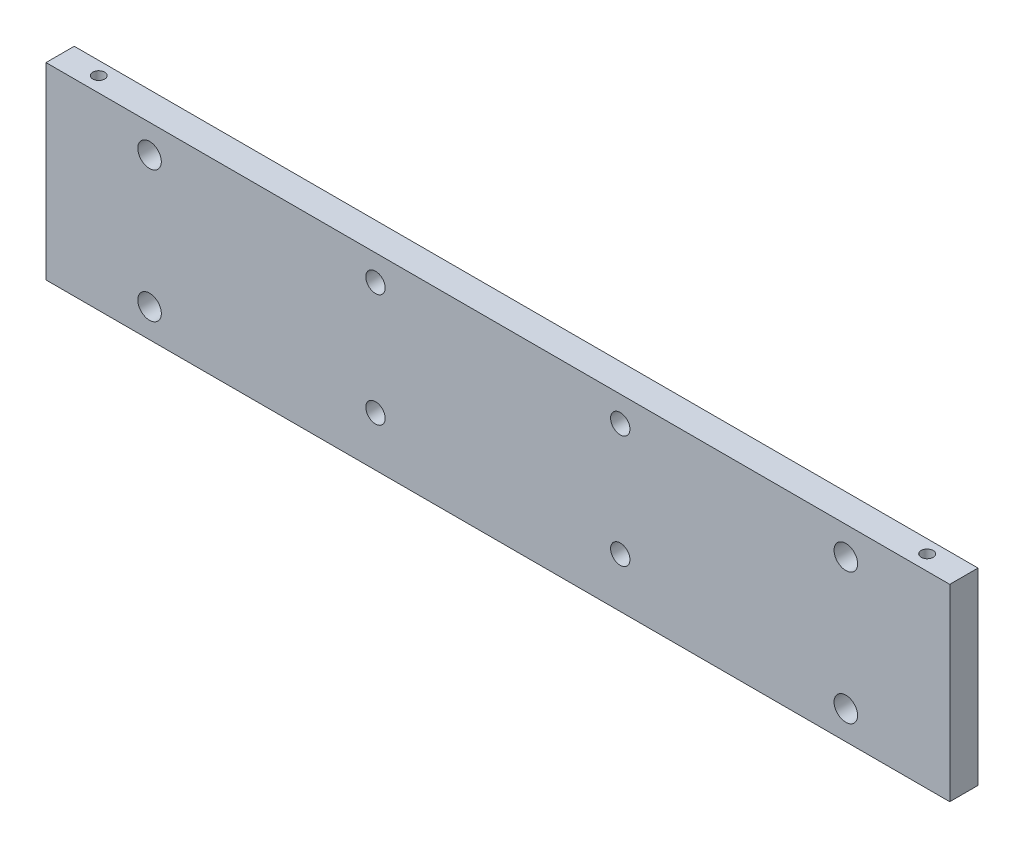
ISO-10303-21;
HEADER;
FILE_DESCRIPTION(('STEP AP214'),'2;1');
FILE_NAME('part.step','',(''),(''),'','','');
FILE_SCHEMA(('AUTOMOTIVE_DESIGN { 1 0 10303 214 1 1 1 1 }'));
ENDSEC;
DATA;
#1=APPLICATION_CONTEXT('core data for automotive mechanical design processes');
#2=APPLICATION_PROTOCOL_DEFINITION('international standard','automotive_design',2000,#1);
#3=PRODUCT_CONTEXT('',#1,'mechanical');
#4=PRODUCT('Part','Part','',(#3));
#5=PRODUCT_RELATED_PRODUCT_CATEGORY('part','',(#4));
#6=PRODUCT_DEFINITION_FORMATION('','',#4);
#7=PRODUCT_DEFINITION_CONTEXT('part definition',#1,'design');
#8=PRODUCT_DEFINITION('design','',#6,#7);
#9=PRODUCT_DEFINITION_SHAPE('','',#8);
#10=(LENGTH_UNIT() NAMED_UNIT(*) SI_UNIT(.MILLI.,.METRE.));
#11=(NAMED_UNIT(*) PLANE_ANGLE_UNIT() SI_UNIT($,.RADIAN.));
#12=(NAMED_UNIT(*) SI_UNIT($,.STERADIAN.) SOLID_ANGLE_UNIT());
#13=UNCERTAINTY_MEASURE_WITH_UNIT(LENGTH_MEASURE(1.E-05),#10,'distance_accuracy_value','');
#14=(GEOMETRIC_REPRESENTATION_CONTEXT(3) GLOBAL_UNCERTAINTY_ASSIGNED_CONTEXT((#13)) GLOBAL_UNIT_ASSIGNED_CONTEXT((#10,
#11,#12)) REPRESENTATION_CONTEXT('',''));
#15=CARTESIAN_POINT('',(0.,0.,0.));
#16=DIRECTION('',(0.,0.,1.));
#17=DIRECTION('',(1.,0.,0.));
#18=AXIS2_PLACEMENT_3D('',#15,#16,#17);
#19=CARTESIAN_POINT('',(152.4,-31.75,9.525));
#20=DIRECTION('',(-1.,0.,0.));
#21=DIRECTION('',(0.,0.,1.));
#22=AXIS2_PLACEMENT_3D('',#19,#20,#21);
#23=PLANE('',#22);
#24=DIRECTION('',(0.,1.,0.));
#25=VECTOR('',#24,1.);
#26=CARTESIAN_POINT('',(152.4,-31.75,0.));
#27=LINE('',#26,#25);
#28=CARTESIAN_POINT('',(152.4,-31.75,0.));
#29=VERTEX_POINT('',#28);
#30=CARTESIAN_POINT('',(152.4,31.75,0.));
#31=VERTEX_POINT('',#30);
#32=EDGE_CURVE('E189',#29,#31,#27,.T.);
#33=ORIENTED_EDGE('',*,*,#32,.T.);
#34=DIRECTION('',(0.,0.,-1.));
#35=VECTOR('',#34,1.);
#36=CARTESIAN_POINT('',(152.4,31.75,9.525));
#37=LINE('',#36,#35);
#38=CARTESIAN_POINT('',(152.4,31.75,9.525));
#39=VERTEX_POINT('',#38);
#40=EDGE_CURVE('E11',#39,#31,#37,.T.);
#41=ORIENTED_EDGE('',*,*,#40,.F.);
#42=DIRECTION('',(0.,1.,0.));
#43=VECTOR('',#42,1.);
#44=CARTESIAN_POINT('',(152.4,-31.75,9.525));
#45=LINE('',#44,#43);
#46=CARTESIAN_POINT('',(152.4,-31.75,9.525));
#47=VERTEX_POINT('',#46);
#48=EDGE_CURVE('E190',#47,#39,#45,.T.);
#49=ORIENTED_EDGE('',*,*,#48,.F.);
#50=DIRECTION('',(0.,0.,-1.));
#51=VECTOR('',#50,1.);
#52=CARTESIAN_POINT('',(152.4,-31.75,9.525));
#53=LINE('',#52,#51);
#54=EDGE_CURVE('E200',#47,#29,#53,.T.);
#55=ORIENTED_EDGE('',*,*,#54,.T.);
#56=EDGE_LOOP('',(#33,#41,#49,#55));
#57=FACE_BOUND('',#56,.T.);
#58=ADVANCED_FACE('F45',(#57),#23,.F.);
#59=CARTESIAN_POINT('',(-152.4,31.75,9.525));
#60=DIRECTION('',(0.,-1.,0.));
#61=DIRECTION('',(0.,0.,-1.));
#62=AXIS2_PLACEMENT_3D('',#59,#60,#61);
#63=PLANE('',#62);
#64=CARTESIAN_POINT('',(-139.7,31.75,4.445));
#65=DIRECTION('',(0.,1.,0.));
#66=DIRECTION('',(0.,0.,1.));
#67=AXIS2_PLACEMENT_3D('',#64,#65,#66);
#68=CIRCLE('',#67,2.0193);
#69=CARTESIAN_POINT('',(-139.7,31.75,6.4643));
#70=VERTEX_POINT('',#69);
#71=EDGE_CURVE('E112',#70,#70,#68,.T.);
#72=ORIENTED_EDGE('',*,*,#71,.F.);
#73=EDGE_LOOP('',(#72));
#74=FACE_BOUND('',#73,.T.);
#75=CARTESIAN_POINT('',(139.7,31.75,4.445));
#76=DIRECTION('',(0.,1.,0.));
#77=DIRECTION('',(0.,0.,1.));
#78=AXIS2_PLACEMENT_3D('',#75,#76,#77);
#79=CIRCLE('',#78,2.0193);
#80=CARTESIAN_POINT('',(139.7,31.75,6.4643));
#81=VERTEX_POINT('',#80);
#82=EDGE_CURVE('E111',#81,#81,#79,.T.);
#83=ORIENTED_EDGE('',*,*,#82,.F.);
#84=EDGE_LOOP('',(#83));
#85=FACE_BOUND('',#84,.T.);
#86=DIRECTION('',(-1.,0.,0.));
#87=VECTOR('',#86,1.);
#88=CARTESIAN_POINT('',(-152.4,31.75,0.));
#89=LINE('',#88,#87);
#90=CARTESIAN_POINT('',(-152.4,31.75,0.));
#91=VERTEX_POINT('',#90);
#92=EDGE_CURVE('E204',#31,#91,#89,.T.);
#93=ORIENTED_EDGE('',*,*,#92,.T.);
#94=DIRECTION('',(0.,0.,-1.));
#95=VECTOR('',#94,1.);
#96=CARTESIAN_POINT('',(-152.4,31.75,9.525));
#97=LINE('',#96,#95);
#98=CARTESIAN_POINT('',(-152.4,31.75,9.525));
#99=VERTEX_POINT('',#98);
#100=EDGE_CURVE('E54',#99,#91,#97,.T.);
#101=ORIENTED_EDGE('',*,*,#100,.F.);
#102=DIRECTION('',(-1.,0.,0.));
#103=VECTOR('',#102,1.);
#104=CARTESIAN_POINT('',(-152.4,31.75,9.525));
#105=LINE('',#104,#103);
#106=EDGE_CURVE('E93',#39,#99,#105,.T.);
#107=ORIENTED_EDGE('',*,*,#106,.F.);
#108=ORIENTED_EDGE('',*,*,#40,.T.);
#109=EDGE_LOOP('',(#93,#101,#107,#108));
#110=FACE_BOUND('',#109,.T.);
#111=ADVANCED_FACE('F234',(#74,#85,#110),#63,.F.);
#112=CARTESIAN_POINT('',(-152.4,-31.75,9.525));
#113=DIRECTION('',(1.,0.,0.));
#114=DIRECTION('',(0.,0.,-1.));
#115=AXIS2_PLACEMENT_3D('',#112,#113,#114);
#116=PLANE('',#115);
#117=DIRECTION('',(0.,-1.,0.));
#118=VECTOR('',#117,1.);
#119=CARTESIAN_POINT('',(-152.4,-31.75,0.));
#120=LINE('',#119,#118);
#121=CARTESIAN_POINT('',(-152.4,-31.75,0.));
#122=VERTEX_POINT('',#121);
#123=EDGE_CURVE('E80',#91,#122,#120,.T.);
#124=ORIENTED_EDGE('',*,*,#123,.T.);
#125=DIRECTION('',(0.,0.,-1.));
#126=VECTOR('',#125,1.);
#127=CARTESIAN_POINT('',(-152.4,-31.75,9.525));
#128=LINE('',#127,#126);
#129=CARTESIAN_POINT('',(-152.4,-31.75,9.525));
#130=VERTEX_POINT('',#129);
#131=EDGE_CURVE('E213',#130,#122,#128,.T.);
#132=ORIENTED_EDGE('',*,*,#131,.F.);
#133=DIRECTION('',(0.,-1.,0.));
#134=VECTOR('',#133,1.);
#135=CARTESIAN_POINT('',(-152.4,-31.75,9.525));
#136=LINE('',#135,#134);
#137=EDGE_CURVE('E195',#99,#130,#136,.T.);
#138=ORIENTED_EDGE('',*,*,#137,.F.);
#139=ORIENTED_EDGE('',*,*,#100,.T.);
#140=EDGE_LOOP('',(#124,#132,#138,#139));
#141=FACE_BOUND('',#140,.T.);
#142=ADVANCED_FACE('F217',(#141),#116,.F.);
#143=CARTESIAN_POINT('',(-152.4,-31.75,9.525));
#144=DIRECTION('',(0.,1.,0.));
#145=DIRECTION('',(0.,0.,1.));
#146=AXIS2_PLACEMENT_3D('',#143,#144,#145);
#147=PLANE('',#146);
#148=DIRECTION('',(1.,0.,0.));
#149=VECTOR('',#148,1.);
#150=CARTESIAN_POINT('',(-152.4,-31.75,0.));
#151=LINE('',#150,#149);
#152=EDGE_CURVE('E86',#122,#29,#151,.T.);
#153=ORIENTED_EDGE('',*,*,#152,.T.);
#154=ORIENTED_EDGE('',*,*,#54,.F.);
#155=DIRECTION('',(1.,0.,0.));
#156=VECTOR('',#155,1.);
#157=CARTESIAN_POINT('',(-152.4,-31.75,9.525));
#158=LINE('',#157,#156);
#159=EDGE_CURVE('E62',#130,#47,#158,.T.);
#160=ORIENTED_EDGE('',*,*,#159,.F.);
#161=ORIENTED_EDGE('',*,*,#131,.T.);
#162=EDGE_LOOP('',(#153,#154,#160,#161));
#163=FACE_BOUND('',#162,.T.);
#164=ADVANCED_FACE('F224',(#163),#147,.F.);
#165=CARTESIAN_POINT('',(0.,0.,9.525));
#166=DIRECTION('',(0.,0.,-1.));
#167=DIRECTION('',(-1.,0.,0.));
#168=AXIS2_PLACEMENT_3D('',#165,#166,#167);
#169=PLANE('',#168);
#170=CARTESIAN_POINT('',(-117.475,22.225,9.525));
#171=DIRECTION('',(0.,0.,1.));
#172=DIRECTION('',(1.,0.,0.));
#173=AXIS2_PLACEMENT_3D('',#170,#171,#172);
#174=CIRCLE('',#173,3.96874999999999);
#175=CARTESIAN_POINT('',(-113.50625,22.225,9.525));
#176=VERTEX_POINT('',#175);
#177=EDGE_CURVE('E125',#176,#176,#174,.T.);
#178=ORIENTED_EDGE('',*,*,#177,.F.);
#179=EDGE_LOOP('',(#178));
#180=FACE_BOUND('',#179,.T.);
#181=CARTESIAN_POINT('',(-117.475,-22.098,9.525));
#182=DIRECTION('',(0.,0.,1.));
#183=DIRECTION('',(1.,0.,0.));
#184=AXIS2_PLACEMENT_3D('',#181,#182,#183);
#185=CIRCLE('',#184,3.96874999999999);
#186=CARTESIAN_POINT('',(-113.50625,-22.098,9.525));
#187=VERTEX_POINT('',#186);
#188=EDGE_CURVE('E133',#187,#187,#185,.T.);
#189=ORIENTED_EDGE('',*,*,#188,.F.);
#190=EDGE_LOOP('',(#189));
#191=FACE_BOUND('',#190,.T.);
#192=CARTESIAN_POINT('',(117.348,-22.098,9.525));
#193=DIRECTION('',(0.,0.,1.));
#194=DIRECTION('',(1.,0.,0.));
#195=AXIS2_PLACEMENT_3D('',#192,#193,#194);
#196=CIRCLE('',#195,3.96874999999999);
#197=CARTESIAN_POINT('',(121.31675,-22.098,9.525));
#198=VERTEX_POINT('',#197);
#199=EDGE_CURVE('E141',#198,#198,#196,.T.);
#200=ORIENTED_EDGE('',*,*,#199,.F.);
#201=EDGE_LOOP('',(#200));
#202=FACE_BOUND('',#201,.T.);
#203=CARTESIAN_POINT('',(117.348,22.225,9.525));
#204=DIRECTION('',(0.,0.,1.));
#205=DIRECTION('',(1.,0.,0.));
#206=AXIS2_PLACEMENT_3D('',#203,#204,#205);
#207=CIRCLE('',#206,3.96874999999999);
#208=CARTESIAN_POINT('',(121.31675,22.225,9.525));
#209=VERTEX_POINT('',#208);
#210=EDGE_CURVE('E149',#209,#209,#207,.T.);
#211=ORIENTED_EDGE('',*,*,#210,.F.);
#212=EDGE_LOOP('',(#211));
#213=FACE_BOUND('',#212,.T.);
#214=CARTESIAN_POINT('',(-41.275,23.114,9.525));
#215=DIRECTION('',(0.,0.,1.));
#216=DIRECTION('',(1.,0.,0.));
#217=AXIS2_PLACEMENT_3D('',#214,#215,#216);
#218=CIRCLE('',#217,3.2639);
#219=CARTESIAN_POINT('',(-38.0111,23.114,9.525));
#220=VERTEX_POINT('',#219);
#221=EDGE_CURVE('E157',#220,#220,#218,.T.);
#222=ORIENTED_EDGE('',*,*,#221,.F.);
#223=EDGE_LOOP('',(#222));
#224=FACE_BOUND('',#223,.T.);
#225=CARTESIAN_POINT('',(41.275,23.114,9.525));
#226=DIRECTION('',(0.,0.,1.));
#227=DIRECTION('',(1.,0.,0.));
#228=AXIS2_PLACEMENT_3D('',#225,#226,#227);
#229=CIRCLE('',#228,3.2639);
#230=CARTESIAN_POINT('',(44.5389,23.114,9.525));
#231=VERTEX_POINT('',#230);
#232=EDGE_CURVE('E165',#231,#231,#229,.T.);
#233=ORIENTED_EDGE('',*,*,#232,.F.);
#234=EDGE_LOOP('',(#233));
#235=FACE_BOUND('',#234,.T.);
#236=CARTESIAN_POINT('',(41.275,-14.986,9.525));
#237=DIRECTION('',(0.,0.,1.));
#238=DIRECTION('',(1.,0.,0.));
#239=AXIS2_PLACEMENT_3D('',#236,#237,#238);
#240=CIRCLE('',#239,3.2639);
#241=CARTESIAN_POINT('',(44.5389,-14.986,9.525));
#242=VERTEX_POINT('',#241);
#243=EDGE_CURVE('E173',#242,#242,#240,.T.);
#244=ORIENTED_EDGE('',*,*,#243,.F.);
#245=EDGE_LOOP('',(#244));
#246=FACE_BOUND('',#245,.T.);
#247=CARTESIAN_POINT('',(-41.275,-14.986,9.525));
#248=DIRECTION('',(0.,0.,1.));
#249=DIRECTION('',(1.,0.,0.));
#250=AXIS2_PLACEMENT_3D('',#247,#248,#249);
#251=CIRCLE('',#250,3.2639);
#252=CARTESIAN_POINT('',(-38.0111,-14.986,9.525));
#253=VERTEX_POINT('',#252);
#254=EDGE_CURVE('E181',#253,#253,#251,.T.);
#255=ORIENTED_EDGE('',*,*,#254,.F.);
#256=EDGE_LOOP('',(#255));
#257=FACE_BOUND('',#256,.T.);
#258=ORIENTED_EDGE('',*,*,#48,.T.);
#259=ORIENTED_EDGE('',*,*,#106,.T.);
#260=ORIENTED_EDGE('',*,*,#137,.T.);
#261=ORIENTED_EDGE('',*,*,#159,.T.);
#262=EDGE_LOOP('',(#258,#259,#260,#261));
#263=FACE_BOUND('',#262,.T.);
#264=ADVANCED_FACE('F226',(#180,#191,#202,#213,#224,#235,#246,#257,#263),#169,.F.);
#265=CARTESIAN_POINT('',(0.,0.,0.));
#266=DIRECTION('',(0.,0.,-1.));
#267=DIRECTION('',(-1.,0.,0.));
#268=AXIS2_PLACEMENT_3D('',#265,#266,#267);
#269=PLANE('',#268);
#270=CARTESIAN_POINT('',(-117.475,22.225,0.));
#271=DIRECTION('',(0.,0.,1.));
#272=DIRECTION('',(1.,0.,0.));
#273=AXIS2_PLACEMENT_3D('',#270,#271,#272);
#274=CIRCLE('',#273,3.96874999999999);
#275=CARTESIAN_POINT('',(-113.50625,22.225,0.));
#276=VERTEX_POINT('',#275);
#277=EDGE_CURVE('E129',#276,#276,#274,.T.);
#278=ORIENTED_EDGE('',*,*,#277,.T.);
#279=EDGE_LOOP('',(#278));
#280=FACE_BOUND('',#279,.T.);
#281=CARTESIAN_POINT('',(-117.475,-22.098,0.));
#282=DIRECTION('',(0.,0.,1.));
#283=DIRECTION('',(1.,0.,0.));
#284=AXIS2_PLACEMENT_3D('',#281,#282,#283);
#285=CIRCLE('',#284,3.96874999999999);
#286=CARTESIAN_POINT('',(-113.50625,-22.098,0.));
#287=VERTEX_POINT('',#286);
#288=EDGE_CURVE('E137',#287,#287,#285,.T.);
#289=ORIENTED_EDGE('',*,*,#288,.T.);
#290=EDGE_LOOP('',(#289));
#291=FACE_BOUND('',#290,.T.);
#292=CARTESIAN_POINT('',(117.348,-22.098,0.));
#293=DIRECTION('',(0.,0.,1.));
#294=DIRECTION('',(1.,0.,0.));
#295=AXIS2_PLACEMENT_3D('',#292,#293,#294);
#296=CIRCLE('',#295,3.96874999999999);
#297=CARTESIAN_POINT('',(121.31675,-22.098,0.));
#298=VERTEX_POINT('',#297);
#299=EDGE_CURVE('E145',#298,#298,#296,.T.);
#300=ORIENTED_EDGE('',*,*,#299,.T.);
#301=EDGE_LOOP('',(#300));
#302=FACE_BOUND('',#301,.T.);
#303=CARTESIAN_POINT('',(117.348,22.225,0.));
#304=DIRECTION('',(0.,0.,1.));
#305=DIRECTION('',(1.,0.,0.));
#306=AXIS2_PLACEMENT_3D('',#303,#304,#305);
#307=CIRCLE('',#306,3.96874999999999);
#308=CARTESIAN_POINT('',(121.31675,22.225,0.));
#309=VERTEX_POINT('',#308);
#310=EDGE_CURVE('E153',#309,#309,#307,.T.);
#311=ORIENTED_EDGE('',*,*,#310,.T.);
#312=EDGE_LOOP('',(#311));
#313=FACE_BOUND('',#312,.T.);
#314=CARTESIAN_POINT('',(-41.275,23.114,0.));
#315=DIRECTION('',(0.,0.,1.));
#316=DIRECTION('',(1.,0.,0.));
#317=AXIS2_PLACEMENT_3D('',#314,#315,#316);
#318=CIRCLE('',#317,3.2639);
#319=CARTESIAN_POINT('',(-38.0111,23.114,0.));
#320=VERTEX_POINT('',#319);
#321=EDGE_CURVE('E161',#320,#320,#318,.T.);
#322=ORIENTED_EDGE('',*,*,#321,.T.);
#323=EDGE_LOOP('',(#322));
#324=FACE_BOUND('',#323,.T.);
#325=CARTESIAN_POINT('',(41.275,23.114,0.));
#326=DIRECTION('',(0.,0.,1.));
#327=DIRECTION('',(1.,0.,0.));
#328=AXIS2_PLACEMENT_3D('',#325,#326,#327);
#329=CIRCLE('',#328,3.2639);
#330=CARTESIAN_POINT('',(44.5389,23.114,0.));
#331=VERTEX_POINT('',#330);
#332=EDGE_CURVE('E169',#331,#331,#329,.T.);
#333=ORIENTED_EDGE('',*,*,#332,.T.);
#334=EDGE_LOOP('',(#333));
#335=FACE_BOUND('',#334,.T.);
#336=CARTESIAN_POINT('',(41.275,-14.986,0.));
#337=DIRECTION('',(0.,0.,1.));
#338=DIRECTION('',(1.,0.,0.));
#339=AXIS2_PLACEMENT_3D('',#336,#337,#338);
#340=CIRCLE('',#339,3.2639);
#341=CARTESIAN_POINT('',(44.5389,-14.986,0.));
#342=VERTEX_POINT('',#341);
#343=EDGE_CURVE('E177',#342,#342,#340,.T.);
#344=ORIENTED_EDGE('',*,*,#343,.T.);
#345=EDGE_LOOP('',(#344));
#346=FACE_BOUND('',#345,.T.);
#347=CARTESIAN_POINT('',(-41.275,-14.986,0.));
#348=DIRECTION('',(0.,0.,1.));
#349=DIRECTION('',(1.,0.,0.));
#350=AXIS2_PLACEMENT_3D('',#347,#348,#349);
#351=CIRCLE('',#350,3.2639);
#352=CARTESIAN_POINT('',(-38.0111,-14.986,0.));
#353=VERTEX_POINT('',#352);
#354=EDGE_CURVE('E185',#353,#353,#351,.T.);
#355=ORIENTED_EDGE('',*,*,#354,.T.);
#356=EDGE_LOOP('',(#355));
#357=FACE_BOUND('',#356,.T.);
#358=ORIENTED_EDGE('',*,*,#32,.F.);
#359=ORIENTED_EDGE('',*,*,#152,.F.);
#360=ORIENTED_EDGE('',*,*,#123,.F.);
#361=ORIENTED_EDGE('',*,*,#92,.F.);
#362=EDGE_LOOP('',(#358,#359,#360,#361));
#363=FACE_BOUND('',#362,.T.);
#364=ADVANCED_FACE('F220',(#280,#291,#302,#313,#324,#335,#346,#357,#363),#269,.T.);
#365=CARTESIAN_POINT('',(-41.275,-14.986,9.525));
#366=DIRECTION('',(0.,0.,1.));
#367=DIRECTION('',(1.,0.,0.));
#368=AXIS2_PLACEMENT_3D('',#365,#366,#367);
#369=CYLINDRICAL_SURFACE('',#368,3.2639);
#370=ORIENTED_EDGE('',*,*,#354,.F.);
#371=EDGE_LOOP('',(#370));
#372=FACE_BOUND('',#371,.T.);
#373=ORIENTED_EDGE('',*,*,#254,.T.);
#374=EDGE_LOOP('',(#373));
#375=FACE_BOUND('',#374,.T.);
#376=ADVANCED_FACE('F287',(#372,#375),#369,.F.);
#377=CARTESIAN_POINT('',(41.275,-14.986,9.525));
#378=DIRECTION('',(0.,0.,1.));
#379=DIRECTION('',(1.,0.,0.));
#380=AXIS2_PLACEMENT_3D('',#377,#378,#379);
#381=CYLINDRICAL_SURFACE('',#380,3.2639);
#382=ORIENTED_EDGE('',*,*,#343,.F.);
#383=EDGE_LOOP('',(#382));
#384=FACE_BOUND('',#383,.T.);
#385=ORIENTED_EDGE('',*,*,#243,.T.);
#386=EDGE_LOOP('',(#385));
#387=FACE_BOUND('',#386,.T.);
#388=ADVANCED_FACE('F283',(#384,#387),#381,.F.);
#389=CARTESIAN_POINT('',(41.275,23.114,9.525));
#390=DIRECTION('',(0.,0.,1.));
#391=DIRECTION('',(1.,0.,0.));
#392=AXIS2_PLACEMENT_3D('',#389,#390,#391);
#393=CYLINDRICAL_SURFACE('',#392,3.2639);
#394=ORIENTED_EDGE('',*,*,#332,.F.);
#395=EDGE_LOOP('',(#394));
#396=FACE_BOUND('',#395,.T.);
#397=ORIENTED_EDGE('',*,*,#232,.T.);
#398=EDGE_LOOP('',(#397));
#399=FACE_BOUND('',#398,.T.);
#400=ADVANCED_FACE('F279',(#396,#399),#393,.F.);
#401=CARTESIAN_POINT('',(-41.275,23.114,9.525));
#402=DIRECTION('',(0.,0.,1.));
#403=DIRECTION('',(1.,0.,0.));
#404=AXIS2_PLACEMENT_3D('',#401,#402,#403);
#405=CYLINDRICAL_SURFACE('',#404,3.2639);
#406=ORIENTED_EDGE('',*,*,#321,.F.);
#407=EDGE_LOOP('',(#406));
#408=FACE_BOUND('',#407,.T.);
#409=ORIENTED_EDGE('',*,*,#221,.T.);
#410=EDGE_LOOP('',(#409));
#411=FACE_BOUND('',#410,.T.);
#412=ADVANCED_FACE('F275',(#408,#411),#405,.F.);
#413=CARTESIAN_POINT('',(117.348,22.225,9.525));
#414=DIRECTION('',(0.,0.,1.));
#415=DIRECTION('',(1.,0.,0.));
#416=AXIS2_PLACEMENT_3D('',#413,#414,#415);
#417=CYLINDRICAL_SURFACE('',#416,3.96874999999999);
#418=ORIENTED_EDGE('',*,*,#310,.F.);
#419=EDGE_LOOP('',(#418));
#420=FACE_BOUND('',#419,.T.);
#421=ORIENTED_EDGE('',*,*,#210,.T.);
#422=EDGE_LOOP('',(#421));
#423=FACE_BOUND('',#422,.T.);
#424=ADVANCED_FACE('F271',(#420,#423),#417,.F.);
#425=CARTESIAN_POINT('',(117.348,-22.098,9.525));
#426=DIRECTION('',(0.,0.,1.));
#427=DIRECTION('',(1.,0.,0.));
#428=AXIS2_PLACEMENT_3D('',#425,#426,#427);
#429=CYLINDRICAL_SURFACE('',#428,3.96874999999999);
#430=ORIENTED_EDGE('',*,*,#299,.F.);
#431=EDGE_LOOP('',(#430));
#432=FACE_BOUND('',#431,.T.);
#433=ORIENTED_EDGE('',*,*,#199,.T.);
#434=EDGE_LOOP('',(#433));
#435=FACE_BOUND('',#434,.T.);
#436=ADVANCED_FACE('F267',(#432,#435),#429,.F.);
#437=CARTESIAN_POINT('',(-117.475,-22.098,9.525));
#438=DIRECTION('',(0.,0.,1.));
#439=DIRECTION('',(1.,0.,0.));
#440=AXIS2_PLACEMENT_3D('',#437,#438,#439);
#441=CYLINDRICAL_SURFACE('',#440,3.96874999999999);
#442=ORIENTED_EDGE('',*,*,#288,.F.);
#443=EDGE_LOOP('',(#442));
#444=FACE_BOUND('',#443,.T.);
#445=ORIENTED_EDGE('',*,*,#188,.T.);
#446=EDGE_LOOP('',(#445));
#447=FACE_BOUND('',#446,.T.);
#448=ADVANCED_FACE('F263',(#444,#447),#441,.F.);
#449=CARTESIAN_POINT('',(-117.475,22.225,9.525));
#450=DIRECTION('',(0.,0.,1.));
#451=DIRECTION('',(1.,0.,0.));
#452=AXIS2_PLACEMENT_3D('',#449,#450,#451);
#453=CYLINDRICAL_SURFACE('',#452,3.96874999999999);
#454=ORIENTED_EDGE('',*,*,#277,.F.);
#455=EDGE_LOOP('',(#454));
#456=FACE_BOUND('',#455,.T.);
#457=ORIENTED_EDGE('',*,*,#177,.T.);
#458=EDGE_LOOP('',(#457));
#459=FACE_BOUND('',#458,.T.);
#460=ADVANCED_FACE('F255',(#456,#459),#453,.F.);
#461=CARTESIAN_POINT('',(139.7,19.812,4.445));
#462=DIRECTION('',(0.,1.,0.));
#463=DIRECTION('',(0.,0.,1.));
#464=AXIS2_PLACEMENT_3D('',#461,#462,#463);
#465=CONICAL_SURFACE('',#464,2.0193,1.02974425867665);
#466=CARTESIAN_POINT('',(139.7,18.5986821519977,4.445));
#467=VERTEX_POINT('',#466);
#468=VERTEX_LOOP('',#467);
#469=FACE_BOUND('',#468,.T.);
#470=CARTESIAN_POINT('',(139.7,19.812,4.445));
#471=DIRECTION('',(0.,1.,0.));
#472=DIRECTION('',(0.,0.,1.));
#473=AXIS2_PLACEMENT_3D('',#470,#471,#472);
#474=CIRCLE('',#473,2.0193);
#475=CARTESIAN_POINT('',(139.7,19.812,6.4643));
#476=VERTEX_POINT('',#475);
#477=EDGE_CURVE('E117',#476,#476,#474,.T.);
#478=ORIENTED_EDGE('',*,*,#477,.T.);
#479=EDGE_LOOP('',(#478));
#480=FACE_BOUND('',#479,.T.);
#481=ADVANCED_FACE('F249',(#469,#480),#465,.F.);
#482=CARTESIAN_POINT('',(139.7,31.75,4.445));
#483=DIRECTION('',(0.,1.,0.));
#484=DIRECTION('',(0.,0.,1.));
#485=AXIS2_PLACEMENT_3D('',#482,#483,#484);
#486=CYLINDRICAL_SURFACE('',#485,2.0193);
#487=ORIENTED_EDGE('',*,*,#477,.F.);
#488=EDGE_LOOP('',(#487));
#489=FACE_BOUND('',#488,.T.);
#490=ORIENTED_EDGE('',*,*,#82,.T.);
#491=EDGE_LOOP('',(#490));
#492=FACE_BOUND('',#491,.T.);
#493=ADVANCED_FACE('F104',(#489,#492),#486,.F.);
#494=CARTESIAN_POINT('',(-139.7,19.812,4.445));
#495=DIRECTION('',(0.,1.,0.));
#496=DIRECTION('',(0.,0.,1.));
#497=AXIS2_PLACEMENT_3D('',#494,#495,#496);
#498=CONICAL_SURFACE('',#497,2.0193,1.02974425867665);
#499=CARTESIAN_POINT('',(-139.7,18.5986821519977,4.445));
#500=VERTEX_POINT('',#499);
#501=VERTEX_LOOP('',#500);
#502=FACE_BOUND('',#501,.T.);
#503=CARTESIAN_POINT('',(-139.7,19.812,4.445));
#504=DIRECTION('',(0.,1.,0.));
#505=DIRECTION('',(0.,0.,1.));
#506=AXIS2_PLACEMENT_3D('',#503,#504,#505);
#507=CIRCLE('',#506,2.0193);
#508=CARTESIAN_POINT('',(-139.7,19.812,6.4643));
#509=VERTEX_POINT('',#508);
#510=EDGE_CURVE('E108',#509,#509,#507,.T.);
#511=ORIENTED_EDGE('',*,*,#510,.T.);
#512=EDGE_LOOP('',(#511));
#513=FACE_BOUND('',#512,.T.);
#514=ADVANCED_FACE('F100',(#502,#513),#498,.F.);
#515=CARTESIAN_POINT('',(-139.7,31.75,4.445));
#516=DIRECTION('',(0.,1.,0.));
#517=DIRECTION('',(0.,0.,1.));
#518=AXIS2_PLACEMENT_3D('',#515,#516,#517);
#519=CYLINDRICAL_SURFACE('',#518,2.0193);
#520=ORIENTED_EDGE('',*,*,#510,.F.);
#521=EDGE_LOOP('',(#520));
#522=FACE_BOUND('',#521,.T.);
#523=ORIENTED_EDGE('',*,*,#71,.T.);
#524=EDGE_LOOP('',(#523));
#525=FACE_BOUND('',#524,.T.);
#526=ADVANCED_FACE('F103',(#522,#525),#519,.F.);
#527=CLOSED_SHELL('',(#58,#111,#142,#164,#264,#364,#376,#388,#400,#412,#424,#436,#448,#460,#481,
#493,#514,#526));
#528=MANIFOLD_SOLID_BREP('B2',#527);
#529=ADVANCED_BREP_SHAPE_REPRESENTATION('',(#18,#528),#14);
#530=SHAPE_DEFINITION_REPRESENTATION(#9,#529);
ENDSEC;
END-ISO-10303-21;
